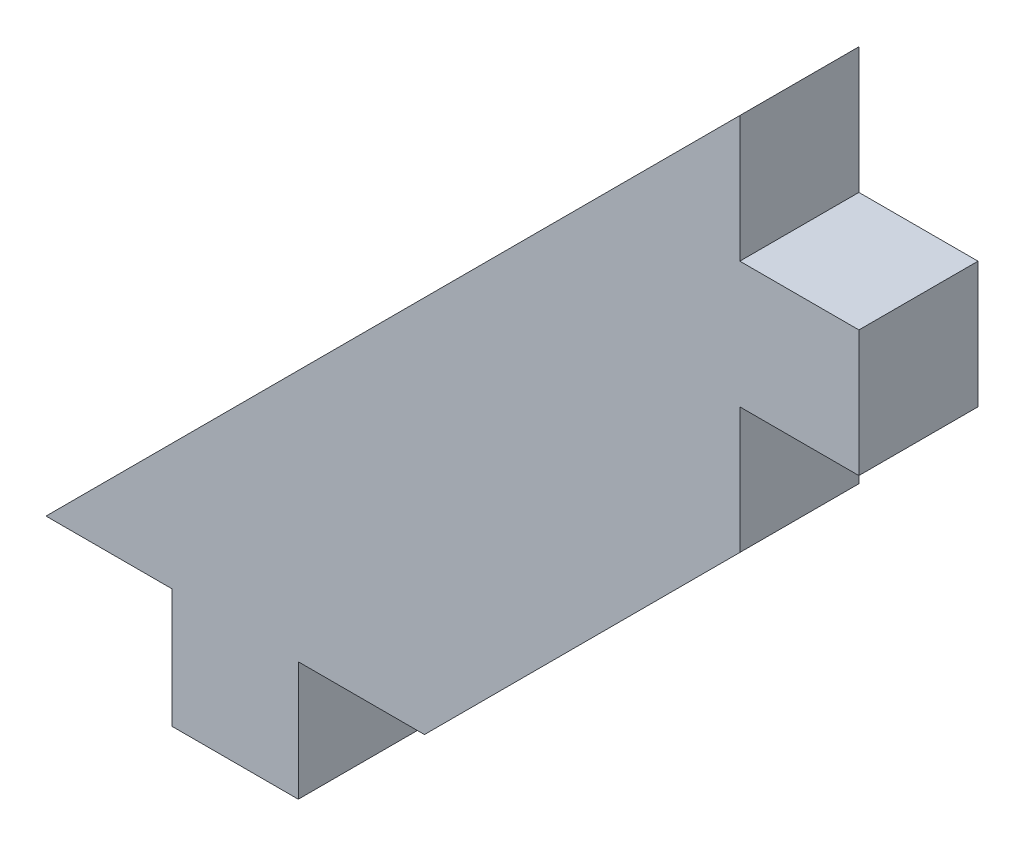
ISO-10303-21;
HEADER;
FILE_DESCRIPTION(('STEP AP214'),'2;1');
FILE_NAME('part.step','',(''),(''),'','','');
FILE_SCHEMA(('AUTOMOTIVE_DESIGN { 1 0 10303 214 1 1 1 1 }'));
ENDSEC;
DATA;
#1=APPLICATION_CONTEXT('core data for automotive mechanical design processes');
#2=APPLICATION_PROTOCOL_DEFINITION('international standard','automotive_design',2000,#1);
#3=PRODUCT_CONTEXT('',#1,'mechanical');
#4=PRODUCT('Part','Part','',(#3));
#5=PRODUCT_RELATED_PRODUCT_CATEGORY('part','',(#4));
#6=PRODUCT_DEFINITION_FORMATION('','',#4);
#7=PRODUCT_DEFINITION_CONTEXT('part definition',#1,'design');
#8=PRODUCT_DEFINITION('design','',#6,#7);
#9=PRODUCT_DEFINITION_SHAPE('','',#8);
#10=(LENGTH_UNIT() NAMED_UNIT(*) SI_UNIT(.MILLI.,.METRE.));
#11=(NAMED_UNIT(*) PLANE_ANGLE_UNIT() SI_UNIT($,.RADIAN.));
#12=(NAMED_UNIT(*) SI_UNIT($,.STERADIAN.) SOLID_ANGLE_UNIT());
#13=UNCERTAINTY_MEASURE_WITH_UNIT(LENGTH_MEASURE(1.E-05),#10,'distance_accuracy_value','');
#14=(GEOMETRIC_REPRESENTATION_CONTEXT(3) GLOBAL_UNCERTAINTY_ASSIGNED_CONTEXT((#13)) GLOBAL_UNIT_ASSIGNED_CONTEXT((#10,
#11,#12)) REPRESENTATION_CONTEXT('',''));
#15=CARTESIAN_POINT('',(0.,0.,0.));
#16=DIRECTION('',(0.,0.,1.));
#17=DIRECTION('',(1.,0.,0.));
#18=AXIS2_PLACEMENT_3D('',#15,#16,#17);
#19=CARTESIAN_POINT('',(28.5749999999999,40.9194000000002,5.9944));
#20=DIRECTION('',(0.70710678118655,-0.707106781186545,0.));
#21=DIRECTION('',(0.707106781186545,0.70710678118655,0.));
#22=AXIS2_PLACEMENT_3D('',#19,#20,#21);
#23=PLANE('',#22);
#24=DIRECTION('',(-0.707106781186545,-0.70710678118655,0.));
#25=VECTOR('',#24,1.);
#26=CARTESIAN_POINT('',(28.5749999999999,40.9194000000002,0.));
#27=LINE('',#26,#25);
#28=CARTESIAN_POINT('',(28.5749999999999,40.9194000000002,0.));
#29=VERTEX_POINT('',#28);
#30=CARTESIAN_POINT('',(-6.34999999999995,5.99440000000014,0.));
#31=VERTEX_POINT('',#30);
#32=EDGE_CURVE('E152',#29,#31,#27,.T.);
#33=ORIENTED_EDGE('',*,*,#32,.T.);
#34=DIRECTION('',(0.,0.,-1.));
#35=VECTOR('',#34,1.);
#36=CARTESIAN_POINT('',(-6.34999999999995,5.99440000000014,5.9944));
#37=LINE('',#36,#35);
#38=CARTESIAN_POINT('',(-6.34999999999995,5.99440000000014,5.9944));
#39=VERTEX_POINT('',#38);
#40=EDGE_CURVE('E11',#39,#31,#37,.T.);
#41=ORIENTED_EDGE('',*,*,#40,.F.);
#42=DIRECTION('',(-0.707106781186545,-0.70710678118655,0.));
#43=VECTOR('',#42,1.);
#44=CARTESIAN_POINT('',(28.5749999999999,40.9194000000002,5.9944));
#45=LINE('',#44,#43);
#46=CARTESIAN_POINT('',(28.5749999999999,40.9194000000002,5.9944));
#47=VERTEX_POINT('',#46);
#48=EDGE_CURVE('E174',#47,#39,#45,.T.);
#49=ORIENTED_EDGE('',*,*,#48,.F.);
#50=DIRECTION('',(0.,0.,-1.));
#51=VECTOR('',#50,1.);
#52=CARTESIAN_POINT('',(28.5749999999999,40.9194000000002,5.9944));
#53=LINE('',#52,#51);
#54=EDGE_CURVE('E148',#47,#29,#53,.T.);
#55=ORIENTED_EDGE('',*,*,#54,.T.);
#56=EDGE_LOOP('',(#33,#41,#49,#55));
#57=FACE_BOUND('',#56,.T.);
#58=ADVANCED_FACE('F32',(#57),#23,.F.);
#59=CARTESIAN_POINT('',(-6.34999999999995,5.99440000000014,5.9944));
#60=DIRECTION('',(0.,1.,0.));
#61=DIRECTION('',(-1.,0.,0.));
#62=AXIS2_PLACEMENT_3D('',#59,#60,#61);
#63=PLANE('',#62);
#64=DIRECTION('',(1.,0.,0.));
#65=VECTOR('',#64,1.);
#66=CARTESIAN_POINT('',(-6.34999999999995,5.99440000000014,0.));
#67=LINE('',#66,#65);
#68=CARTESIAN_POINT('',(0.,5.9944,0.));
#69=VERTEX_POINT('',#68);
#70=EDGE_CURVE('E155',#31,#69,#67,.T.);
#71=ORIENTED_EDGE('',*,*,#70,.T.);
#72=DIRECTION('',(0.,0.,-1.));
#73=VECTOR('',#72,1.);
#74=CARTESIAN_POINT('',(0.,5.9944,5.9944));
#75=LINE('',#74,#73);
#76=CARTESIAN_POINT('',(0.,5.9944,5.9944));
#77=VERTEX_POINT('',#76);
#78=EDGE_CURVE('E40',#77,#69,#75,.T.);
#79=ORIENTED_EDGE('',*,*,#78,.F.);
#80=DIRECTION('',(1.,0.,0.));
#81=VECTOR('',#80,1.);
#82=CARTESIAN_POINT('',(-6.34999999999995,5.99440000000014,5.9944));
#83=LINE('',#82,#81);
#84=EDGE_CURVE('E103',#39,#77,#83,.T.);
#85=ORIENTED_EDGE('',*,*,#84,.F.);
#86=ORIENTED_EDGE('',*,*,#40,.T.);
#87=EDGE_LOOP('',(#71,#79,#85,#86));
#88=FACE_BOUND('',#87,.T.);
#89=ADVANCED_FACE('F252',(#88),#63,.F.);
#90=CARTESIAN_POINT('',(0.,5.9944,5.9944));
#91=DIRECTION('',(1.,0.,0.));
#92=DIRECTION('',(0.,1.,0.));
#93=AXIS2_PLACEMENT_3D('',#90,#91,#92);
#94=PLANE('',#93);
#95=DIRECTION('',(0.,-1.,0.));
#96=VECTOR('',#95,1.);
#97=CARTESIAN_POINT('',(0.,5.9944,0.));
#98=LINE('',#97,#96);
#99=CARTESIAN_POINT('',(0.,0.,0.));
#100=VERTEX_POINT('',#99);
#101=EDGE_CURVE('E157',#69,#100,#98,.T.);
#102=ORIENTED_EDGE('',*,*,#101,.T.);
#103=DIRECTION('',(0.,0.,-1.));
#104=VECTOR('',#103,1.);
#105=CARTESIAN_POINT('',(0.,0.,5.9944));
#106=LINE('',#105,#104);
#107=CARTESIAN_POINT('',(0.,0.,5.9944));
#108=VERTEX_POINT('',#107);
#109=EDGE_CURVE('E193',#108,#100,#106,.T.);
#110=ORIENTED_EDGE('',*,*,#109,.F.);
#111=DIRECTION('',(0.,-1.,0.));
#112=VECTOR('',#111,1.);
#113=CARTESIAN_POINT('',(0.,5.9944,5.9944));
#114=LINE('',#113,#112);
#115=EDGE_CURVE('E201',#77,#108,#114,.T.);
#116=ORIENTED_EDGE('',*,*,#115,.F.);
#117=ORIENTED_EDGE('',*,*,#78,.T.);
#118=EDGE_LOOP('',(#102,#110,#116,#117));
#119=FACE_BOUND('',#118,.T.);
#120=ADVANCED_FACE('F199',(#119),#94,.F.);
#121=CARTESIAN_POINT('',(0.,0.,5.9944));
#122=DIRECTION('',(0.,1.,0.));
#123=DIRECTION('',(0.,0.,1.));
#124=AXIS2_PLACEMENT_3D('',#121,#122,#123);
#125=PLANE('',#124);
#126=DIRECTION('',(1.,0.,0.));
#127=VECTOR('',#126,1.);
#128=CARTESIAN_POINT('',(0.,0.,0.));
#129=LINE('',#128,#127);
#130=CARTESIAN_POINT('',(6.34999999999998,0.,0.));
#131=VERTEX_POINT('',#130);
#132=EDGE_CURVE('E159',#100,#131,#129,.T.);
#133=ORIENTED_EDGE('',*,*,#132,.T.);
#134=DIRECTION('',(0.,0.,-1.));
#135=VECTOR('',#134,1.);
#136=CARTESIAN_POINT('',(6.34999999999998,0.,5.9944));
#137=LINE('',#136,#135);
#138=CARTESIAN_POINT('',(6.34999999999998,0.,5.9944));
#139=VERTEX_POINT('',#138);
#140=EDGE_CURVE('E190',#139,#131,#137,.T.);
#141=ORIENTED_EDGE('',*,*,#140,.F.);
#142=DIRECTION('',(1.,0.,0.));
#143=VECTOR('',#142,1.);
#144=CARTESIAN_POINT('',(0.,0.,5.9944));
#145=LINE('',#144,#143);
#146=EDGE_CURVE('E219',#108,#139,#145,.T.);
#147=ORIENTED_EDGE('',*,*,#146,.F.);
#148=ORIENTED_EDGE('',*,*,#109,.T.);
#149=EDGE_LOOP('',(#133,#141,#147,#148));
#150=FACE_BOUND('',#149,.T.);
#151=ADVANCED_FACE('F210',(#150),#125,.F.);
#152=CARTESIAN_POINT('',(6.34999999999998,0.,5.9944));
#153=DIRECTION('',(-1.,0.,0.));
#154=DIRECTION('',(0.,-1.,0.));
#155=AXIS2_PLACEMENT_3D('',#152,#153,#154);
#156=PLANE('',#155);
#157=DIRECTION('',(0.,1.,0.));
#158=VECTOR('',#157,1.);
#159=CARTESIAN_POINT('',(6.34999999999998,0.,0.));
#160=LINE('',#159,#158);
#161=CARTESIAN_POINT('',(6.35000000000004,5.99439999999998,0.));
#162=VERTEX_POINT('',#161);
#163=EDGE_CURVE('E161',#131,#162,#160,.T.);
#164=ORIENTED_EDGE('',*,*,#163,.T.);
#165=DIRECTION('',(0.,0.,-1.));
#166=VECTOR('',#165,1.);
#167=CARTESIAN_POINT('',(6.35000000000004,5.99439999999998,5.9944));
#168=LINE('',#167,#166);
#169=CARTESIAN_POINT('',(6.35000000000004,5.99439999999998,5.9944));
#170=VERTEX_POINT('',#169);
#171=EDGE_CURVE('E187',#170,#162,#168,.T.);
#172=ORIENTED_EDGE('',*,*,#171,.F.);
#173=DIRECTION('',(0.,1.,0.));
#174=VECTOR('',#173,1.);
#175=CARTESIAN_POINT('',(6.34999999999998,0.,5.9944));
#176=LINE('',#175,#174);
#177=EDGE_CURVE('E216',#139,#170,#176,.T.);
#178=ORIENTED_EDGE('',*,*,#177,.F.);
#179=ORIENTED_EDGE('',*,*,#140,.T.);
#180=EDGE_LOOP('',(#164,#172,#178,#179));
#181=FACE_BOUND('',#180,.T.);
#182=ADVANCED_FACE('F214',(#181),#156,.F.);
#183=CARTESIAN_POINT('',(6.35000000000004,5.99439999999998,5.9944));
#184=DIRECTION('',(0.,1.,0.));
#185=DIRECTION('',(-1.,0.,0.));
#186=AXIS2_PLACEMENT_3D('',#183,#184,#185);
#187=PLANE('',#186);
#188=DIRECTION('',(1.,0.,0.));
#189=VECTOR('',#188,1.);
#190=CARTESIAN_POINT('',(6.35000000000004,5.99439999999998,0.));
#191=LINE('',#190,#189);
#192=CARTESIAN_POINT('',(12.7,5.99439999999995,0.));
#193=VERTEX_POINT('',#192);
#194=EDGE_CURVE('E163',#162,#193,#191,.T.);
#195=ORIENTED_EDGE('',*,*,#194,.T.);
#196=DIRECTION('',(0.,0.,-1.));
#197=VECTOR('',#196,1.);
#198=CARTESIAN_POINT('',(12.7,5.99439999999995,5.9944));
#199=LINE('',#198,#197);
#200=CARTESIAN_POINT('',(12.7,5.99439999999995,5.9944));
#201=VERTEX_POINT('',#200);
#202=EDGE_CURVE('E184',#201,#193,#199,.T.);
#203=ORIENTED_EDGE('',*,*,#202,.F.);
#204=DIRECTION('',(1.,0.,0.));
#205=VECTOR('',#204,1.);
#206=CARTESIAN_POINT('',(6.35000000000004,5.99439999999998,5.9944));
#207=LINE('',#206,#205);
#208=EDGE_CURVE('E218',#170,#201,#207,.T.);
#209=ORIENTED_EDGE('',*,*,#208,.F.);
#210=ORIENTED_EDGE('',*,*,#171,.T.);
#211=EDGE_LOOP('',(#195,#203,#209,#210));
#212=FACE_BOUND('',#211,.T.);
#213=ADVANCED_FACE('F265',(#212),#187,.F.);
#214=CARTESIAN_POINT('',(12.7,5.99439999999995,5.9944));
#215=DIRECTION('',(-0.707106781186544,0.707106781186551,0.));
#216=DIRECTION('',(-0.707106781186551,-0.707106781186544,0.));
#217=AXIS2_PLACEMENT_3D('',#214,#215,#216);
#218=PLANE('',#217);
#219=DIRECTION('',(0.707106781186551,0.707106781186544,0.));
#220=VECTOR('',#219,1.);
#221=CARTESIAN_POINT('',(12.7,5.99439999999995,0.));
#222=LINE('',#221,#220);
#223=CARTESIAN_POINT('',(28.5749999999999,21.8693999999998,0.));
#224=VERTEX_POINT('',#223);
#225=EDGE_CURVE('E165',#193,#224,#222,.T.);
#226=ORIENTED_EDGE('',*,*,#225,.T.);
#227=DIRECTION('',(0.,0.,-1.));
#228=VECTOR('',#227,1.);
#229=CARTESIAN_POINT('',(28.5749999999999,21.8693999999998,5.9944));
#230=LINE('',#229,#228);
#231=CARTESIAN_POINT('',(28.5749999999999,21.8693999999998,5.9944));
#232=VERTEX_POINT('',#231);
#233=EDGE_CURVE('E181',#232,#224,#230,.T.);
#234=ORIENTED_EDGE('',*,*,#233,.F.);
#235=DIRECTION('',(0.707106781186551,0.707106781186544,0.));
#236=VECTOR('',#235,1.);
#237=CARTESIAN_POINT('',(12.7,5.99439999999995,5.9944));
#238=LINE('',#237,#236);
#239=EDGE_CURVE('E221',#201,#232,#238,.T.);
#240=ORIENTED_EDGE('',*,*,#239,.F.);
#241=ORIENTED_EDGE('',*,*,#202,.T.);
#242=EDGE_LOOP('',(#226,#234,#240,#241));
#243=FACE_BOUND('',#242,.T.);
#244=ADVANCED_FACE('F268',(#243),#218,.F.);
#245=CARTESIAN_POINT('',(28.5749999999999,21.8693999999998,5.9944));
#246=DIRECTION('',(-1.,0.,0.));
#247=DIRECTION('',(0.,-1.,0.));
#248=AXIS2_PLACEMENT_3D('',#245,#246,#247);
#249=PLANE('',#248);
#250=DIRECTION('',(0.,1.,0.));
#251=VECTOR('',#250,1.);
#252=CARTESIAN_POINT('',(28.5749999999999,21.8693999999998,0.));
#253=LINE('',#252,#251);
#254=CARTESIAN_POINT('',(28.5749999999999,28.2193999999999,0.));
#255=VERTEX_POINT('',#254);
#256=EDGE_CURVE('E167',#224,#255,#253,.T.);
#257=ORIENTED_EDGE('',*,*,#256,.T.);
#258=DIRECTION('',(0.,0.,-1.));
#259=VECTOR('',#258,1.);
#260=CARTESIAN_POINT('',(28.5749999999999,28.2193999999999,5.9944));
#261=LINE('',#260,#259);
#262=CARTESIAN_POINT('',(28.5749999999999,28.2193999999999,5.9944));
#263=VERTEX_POINT('',#262);
#264=EDGE_CURVE('E178',#263,#255,#261,.T.);
#265=ORIENTED_EDGE('',*,*,#264,.F.);
#266=DIRECTION('',(0.,1.,0.));
#267=VECTOR('',#266,1.);
#268=CARTESIAN_POINT('',(28.5749999999999,21.8693999999998,5.9944));
#269=LINE('',#268,#267);
#270=EDGE_CURVE('E227',#232,#263,#269,.T.);
#271=ORIENTED_EDGE('',*,*,#270,.F.);
#272=ORIENTED_EDGE('',*,*,#233,.T.);
#273=EDGE_LOOP('',(#257,#265,#271,#272));
#274=FACE_BOUND('',#273,.T.);
#275=ADVANCED_FACE('F233',(#274),#249,.F.);
#276=CARTESIAN_POINT('',(28.5749999999999,28.2193999999999,5.9944));
#277=DIRECTION('',(0.,1.,0.));
#278=DIRECTION('',(-1.,0.,0.));
#279=AXIS2_PLACEMENT_3D('',#276,#277,#278);
#280=PLANE('',#279);
#281=DIRECTION('',(1.,0.,0.));
#282=VECTOR('',#281,1.);
#283=CARTESIAN_POINT('',(28.5749999999999,28.2193999999999,0.));
#284=LINE('',#283,#282);
#285=CARTESIAN_POINT('',(34.5693999999999,28.2194,0.));
#286=VERTEX_POINT('',#285);
#287=EDGE_CURVE('E169',#255,#286,#284,.T.);
#288=ORIENTED_EDGE('',*,*,#287,.T.);
#289=DIRECTION('',(0.,0.,-1.));
#290=VECTOR('',#289,1.);
#291=CARTESIAN_POINT('',(34.5693999999999,28.2194,5.9944));
#292=LINE('',#291,#290);
#293=CARTESIAN_POINT('',(34.5693999999999,28.2194,5.9944));
#294=VERTEX_POINT('',#293);
#295=EDGE_CURVE('E143',#294,#286,#292,.T.);
#296=ORIENTED_EDGE('',*,*,#295,.F.);
#297=DIRECTION('',(1.,0.,0.));
#298=VECTOR('',#297,1.);
#299=CARTESIAN_POINT('',(28.5749999999999,28.2193999999999,5.9944));
#300=LINE('',#299,#298);
#301=EDGE_CURVE('E134',#263,#294,#300,.T.);
#302=ORIENTED_EDGE('',*,*,#301,.F.);
#303=ORIENTED_EDGE('',*,*,#264,.T.);
#304=EDGE_LOOP('',(#288,#296,#302,#303));
#305=FACE_BOUND('',#304,.T.);
#306=ADVANCED_FACE('F237',(#305),#280,.F.);
#307=CARTESIAN_POINT('',(34.5693999999999,34.5694000000001,5.9944));
#308=DIRECTION('',(-1.,0.,0.));
#309=DIRECTION('',(0.,0.,1.));
#310=AXIS2_PLACEMENT_3D('',#307,#308,#309);
#311=PLANE('',#310);
#312=DIRECTION('',(0.,1.,0.));
#313=VECTOR('',#312,1.);
#314=CARTESIAN_POINT('',(34.5693999999999,34.5694000000001,0.));
#315=LINE('',#314,#313);
#316=CARTESIAN_POINT('',(34.5693999999999,34.5694000000001,0.));
#317=VERTEX_POINT('',#316);
#318=EDGE_CURVE('E142',#286,#317,#315,.T.);
#319=ORIENTED_EDGE('',*,*,#318,.T.);
#320=DIRECTION('',(0.,0.,-1.));
#321=VECTOR('',#320,1.);
#322=CARTESIAN_POINT('',(34.5693999999999,34.5694000000001,5.9944));
#323=LINE('',#322,#321);
#324=CARTESIAN_POINT('',(34.5693999999999,34.5694000000001,5.9944));
#325=VERTEX_POINT('',#324);
#326=EDGE_CURVE('E139',#325,#317,#323,.T.);
#327=ORIENTED_EDGE('',*,*,#326,.F.);
#328=DIRECTION('',(0.,1.,0.));
#329=VECTOR('',#328,1.);
#330=CARTESIAN_POINT('',(34.5693999999999,34.5694000000001,5.9944));
#331=LINE('',#330,#329);
#332=EDGE_CURVE('E128',#294,#325,#331,.T.);
#333=ORIENTED_EDGE('',*,*,#332,.F.);
#334=ORIENTED_EDGE('',*,*,#295,.T.);
#335=EDGE_LOOP('',(#319,#327,#333,#334));
#336=FACE_BOUND('',#335,.T.);
#337=ADVANCED_FACE('F140',(#336),#311,.F.);
#338=CARTESIAN_POINT('',(34.5693999999999,34.5694000000001,5.9944));
#339=DIRECTION('',(0.,-1.,0.));
#340=DIRECTION('',(1.,0.,0.));
#341=AXIS2_PLACEMENT_3D('',#338,#339,#340);
#342=PLANE('',#341);
#343=DIRECTION('',(-1.,0.,0.));
#344=VECTOR('',#343,1.);
#345=CARTESIAN_POINT('',(34.5693999999999,34.5694000000001,0.));
#346=LINE('',#345,#344);
#347=CARTESIAN_POINT('',(28.5749999999999,34.5694,0.));
#348=VERTEX_POINT('',#347);
#349=EDGE_CURVE('E89',#317,#348,#346,.T.);
#350=ORIENTED_EDGE('',*,*,#349,.T.);
#351=DIRECTION('',(0.,0.,-1.));
#352=VECTOR('',#351,1.);
#353=CARTESIAN_POINT('',(28.5749999999999,34.5694,5.9944));
#354=LINE('',#353,#352);
#355=CARTESIAN_POINT('',(28.5749999999999,34.5694,5.9944));
#356=VERTEX_POINT('',#355);
#357=EDGE_CURVE('E144',#356,#348,#354,.T.);
#358=ORIENTED_EDGE('',*,*,#357,.F.);
#359=DIRECTION('',(-1.,0.,0.));
#360=VECTOR('',#359,1.);
#361=CARTESIAN_POINT('',(34.5693999999999,34.5694000000001,5.9944));
#362=LINE('',#361,#360);
#363=EDGE_CURVE('E132',#325,#356,#362,.T.);
#364=ORIENTED_EDGE('',*,*,#363,.F.);
#365=ORIENTED_EDGE('',*,*,#326,.T.);
#366=EDGE_LOOP('',(#350,#358,#364,#365));
#367=FACE_BOUND('',#366,.T.);
#368=ADVANCED_FACE('F146',(#367),#342,.F.);
#369=CARTESIAN_POINT('',(28.5749999999999,34.5694,5.9944));
#370=DIRECTION('',(-1.,0.,0.));
#371=DIRECTION('',(0.,-1.,0.));
#372=AXIS2_PLACEMENT_3D('',#369,#370,#371);
#373=PLANE('',#372);
#374=DIRECTION('',(0.,1.,0.));
#375=VECTOR('',#374,1.);
#376=CARTESIAN_POINT('',(28.5749999999999,34.5694,0.));
#377=LINE('',#376,#375);
#378=EDGE_CURVE('E95',#348,#29,#377,.T.);
#379=ORIENTED_EDGE('',*,*,#378,.T.);
#380=ORIENTED_EDGE('',*,*,#54,.F.);
#381=DIRECTION('',(0.,1.,0.));
#382=VECTOR('',#381,1.);
#383=CARTESIAN_POINT('',(28.5749999999999,34.5694,5.9944));
#384=LINE('',#383,#382);
#385=EDGE_CURVE('E48',#356,#47,#384,.T.);
#386=ORIENTED_EDGE('',*,*,#385,.F.);
#387=ORIENTED_EDGE('',*,*,#357,.T.);
#388=EDGE_LOOP('',(#379,#380,#386,#387));
#389=FACE_BOUND('',#388,.T.);
#390=ADVANCED_FACE('F241',(#389),#373,.F.);
#391=CARTESIAN_POINT('',(0.,0.,5.9944));
#392=DIRECTION('',(0.,0.,1.));
#393=DIRECTION('',(1.,0.,0.));
#394=AXIS2_PLACEMENT_3D('',#391,#392,#393);
#395=PLANE('',#394);
#396=ORIENTED_EDGE('',*,*,#48,.T.);
#397=ORIENTED_EDGE('',*,*,#84,.T.);
#398=ORIENTED_EDGE('',*,*,#115,.T.);
#399=ORIENTED_EDGE('',*,*,#146,.T.);
#400=ORIENTED_EDGE('',*,*,#177,.T.);
#401=ORIENTED_EDGE('',*,*,#208,.T.);
#402=ORIENTED_EDGE('',*,*,#239,.T.);
#403=ORIENTED_EDGE('',*,*,#270,.T.);
#404=ORIENTED_EDGE('',*,*,#301,.T.);
#405=ORIENTED_EDGE('',*,*,#332,.T.);
#406=ORIENTED_EDGE('',*,*,#363,.T.);
#407=ORIENTED_EDGE('',*,*,#385,.T.);
#408=EDGE_LOOP('',(#396,#397,#398,#399,#400,#401,#402,#403,#404,#405,#406,#407));
#409=FACE_BOUND('',#408,.T.);
#410=ADVANCED_FACE('F130',(#409),#395,.T.);
#411=CARTESIAN_POINT('',(0.,0.,0.));
#412=DIRECTION('',(0.,0.,1.));
#413=DIRECTION('',(1.,0.,0.));
#414=AXIS2_PLACEMENT_3D('',#411,#412,#413);
#415=PLANE('',#414);
#416=ORIENTED_EDGE('',*,*,#32,.F.);
#417=ORIENTED_EDGE('',*,*,#378,.F.);
#418=ORIENTED_EDGE('',*,*,#349,.F.);
#419=ORIENTED_EDGE('',*,*,#318,.F.);
#420=ORIENTED_EDGE('',*,*,#287,.F.);
#421=ORIENTED_EDGE('',*,*,#256,.F.);
#422=ORIENTED_EDGE('',*,*,#225,.F.);
#423=ORIENTED_EDGE('',*,*,#194,.F.);
#424=ORIENTED_EDGE('',*,*,#163,.F.);
#425=ORIENTED_EDGE('',*,*,#132,.F.);
#426=ORIENTED_EDGE('',*,*,#101,.F.);
#427=ORIENTED_EDGE('',*,*,#70,.F.);
#428=EDGE_LOOP('',(#416,#417,#418,#419,#420,#421,#422,#423,#424,#425,#426,#427));
#429=FACE_BOUND('',#428,.T.);
#430=ADVANCED_FACE('F205',(#429),#415,.F.);
#431=CLOSED_SHELL('',(#58,#89,#120,#151,#182,#213,#244,#275,#306,#337,#368,#390,#410,#430));
#432=MANIFOLD_SOLID_BREP('B2',#431);
#433=ADVANCED_BREP_SHAPE_REPRESENTATION('',(#18,#432),#14);
#434=SHAPE_DEFINITION_REPRESENTATION(#9,#433);
ENDSEC;
END-ISO-10303-21;
